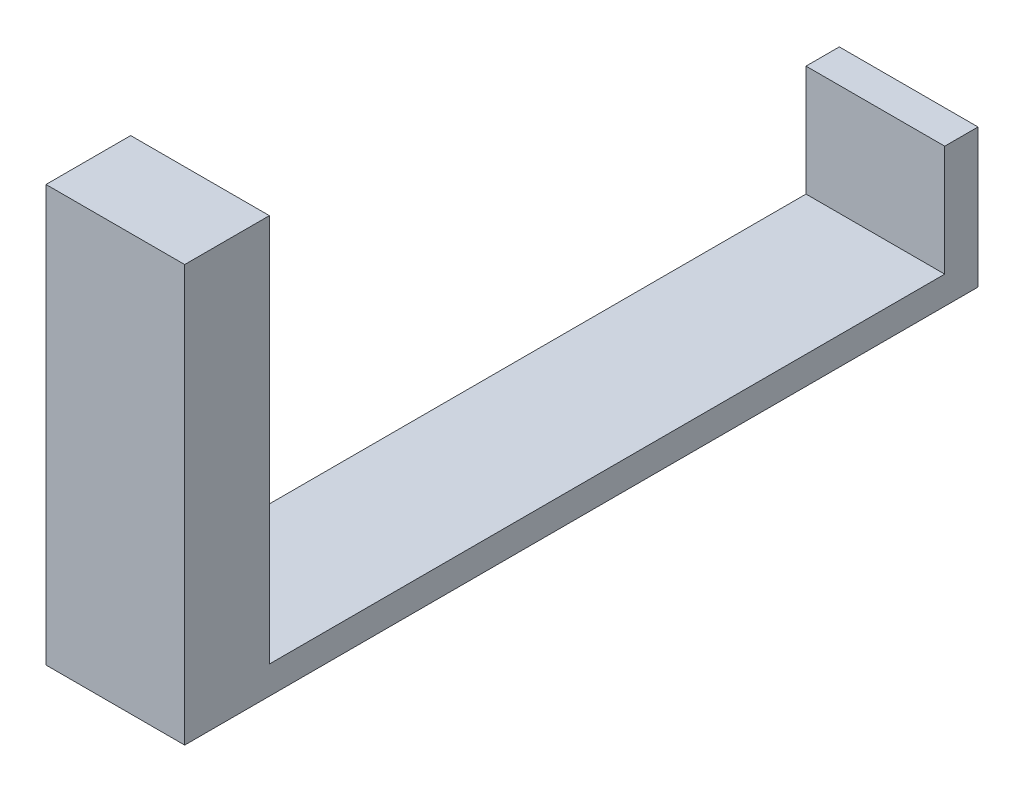
ISO-10303-21;
HEADER;
FILE_DESCRIPTION(('STEP AP214'),'2;1');
FILE_NAME('part.step','',(''),(''),'','','');
FILE_SCHEMA(('AUTOMOTIVE_DESIGN { 1 0 10303 214 1 1 1 1 }'));
ENDSEC;
DATA;
#1=APPLICATION_CONTEXT('core data for automotive mechanical design processes');
#2=APPLICATION_PROTOCOL_DEFINITION('international standard','automotive_design',2000,#1);
#3=PRODUCT_CONTEXT('',#1,'mechanical');
#4=PRODUCT('Part','Part','',(#3));
#5=PRODUCT_RELATED_PRODUCT_CATEGORY('part','',(#4));
#6=PRODUCT_DEFINITION_FORMATION('','',#4);
#7=PRODUCT_DEFINITION_CONTEXT('part definition',#1,'design');
#8=PRODUCT_DEFINITION('design','',#6,#7);
#9=PRODUCT_DEFINITION_SHAPE('','',#8);
#10=(LENGTH_UNIT() NAMED_UNIT(*) SI_UNIT(.MILLI.,.METRE.));
#11=(NAMED_UNIT(*) PLANE_ANGLE_UNIT() SI_UNIT($,.RADIAN.));
#12=(NAMED_UNIT(*) SI_UNIT($,.STERADIAN.) SOLID_ANGLE_UNIT());
#13=UNCERTAINTY_MEASURE_WITH_UNIT(LENGTH_MEASURE(1.E-05),#10,'distance_accuracy_value','');
#14=(GEOMETRIC_REPRESENTATION_CONTEXT(3) GLOBAL_UNCERTAINTY_ASSIGNED_CONTEXT((#13)) GLOBAL_UNIT_ASSIGNED_CONTEXT((#10,
#11,#12)) REPRESENTATION_CONTEXT('',''));
#15=CARTESIAN_POINT('',(0.,0.,0.));
#16=DIRECTION('',(0.,0.,1.));
#17=DIRECTION('',(1.,0.,0.));
#18=AXIS2_PLACEMENT_3D('',#15,#16,#17);
#19=CARTESIAN_POINT('',(0.,50.2336626959557,1430.));
#20=DIRECTION('',(0.,-1.,0.));
#21=DIRECTION('',(0.,0.,-1.));
#22=AXIS2_PLACEMENT_3D('',#19,#20,#21);
#23=PLANE('',#22);
#24=DIRECTION('',(-1.,0.,0.));
#25=VECTOR('',#24,1.);
#26=CARTESIAN_POINT('',(0.,50.2336626959557,1277.33604646102));
#27=LINE('',#26,#25);
#28=CARTESIAN_POINT('',(0.,50.2336626959557,1277.33604646102));
#29=VERTEX_POINT('',#28);
#30=CARTESIAN_POINT('',(-250.,50.2336626959557,1277.33604646102));
#31=VERTEX_POINT('',#30);
#32=EDGE_CURVE('E170',#29,#31,#27,.T.);
#33=ORIENTED_EDGE('',*,*,#32,.F.);
#34=DIRECTION('',(0.,0.,-1.));
#35=VECTOR('',#34,1.);
#36=CARTESIAN_POINT('',(0.,50.2336626959557,1430.));
#37=LINE('',#36,#35);
#38=CARTESIAN_POINT('',(0.,50.2336626959557,60.));
#39=VERTEX_POINT('',#38);
#40=EDGE_CURVE('E61',#29,#39,#37,.T.);
#41=ORIENTED_EDGE('',*,*,#40,.T.);
#42=DIRECTION('',(-1.,0.,0.));
#43=VECTOR('',#42,1.);
#44=CARTESIAN_POINT('',(0.,50.2336626959557,60.));
#45=LINE('',#44,#43);
#46=CARTESIAN_POINT('',(-250.,50.2336626959557,60.));
#47=VERTEX_POINT('',#46);
#48=EDGE_CURVE('E139',#39,#47,#45,.T.);
#49=ORIENTED_EDGE('',*,*,#48,.T.);
#50=DIRECTION('',(0.,0.,-1.));
#51=VECTOR('',#50,1.);
#52=CARTESIAN_POINT('',(-250.,50.2336626959557,1430.));
#53=LINE('',#52,#51);
#54=EDGE_CURVE('E156',#31,#47,#53,.T.);
#55=ORIENTED_EDGE('',*,*,#54,.F.);
#56=EDGE_LOOP('',(#33,#41,#49,#55));
#57=FACE_BOUND('',#56,.T.);
#58=ADVANCED_FACE('F43',(#57),#23,.F.);
#59=CARTESIAN_POINT('',(0.,0.,60.));
#60=DIRECTION('',(0.,0.,-1.));
#61=DIRECTION('',(-1.,0.,0.));
#62=AXIS2_PLACEMENT_3D('',#59,#60,#61);
#63=PLANE('',#62);
#64=ORIENTED_EDGE('',*,*,#48,.F.);
#65=DIRECTION('',(0.,-1.,0.));
#66=VECTOR('',#65,1.);
#67=CARTESIAN_POINT('',(0.,250.,60.));
#68=LINE('',#67,#66);
#69=CARTESIAN_POINT('',(0.,250.,60.));
#70=VERTEX_POINT('',#69);
#71=EDGE_CURVE('E127',#70,#39,#68,.T.);
#72=ORIENTED_EDGE('',*,*,#71,.F.);
#73=DIRECTION('',(1.,0.,0.));
#74=VECTOR('',#73,1.);
#75=CARTESIAN_POINT('',(-250.,250.,60.));
#76=LINE('',#75,#74);
#77=CARTESIAN_POINT('',(-250.,250.,60.));
#78=VERTEX_POINT('',#77);
#79=EDGE_CURVE('E117',#78,#70,#76,.T.);
#80=ORIENTED_EDGE('',*,*,#79,.F.);
#81=DIRECTION('',(0.,1.,0.));
#82=VECTOR('',#81,1.);
#83=CARTESIAN_POINT('',(-250.,0.,60.));
#84=LINE('',#83,#82);
#85=EDGE_CURVE('E113',#47,#78,#84,.T.);
#86=ORIENTED_EDGE('',*,*,#85,.F.);
#87=EDGE_LOOP('',(#64,#72,#80,#86));
#88=FACE_BOUND('',#87,.T.);
#89=ADVANCED_FACE('F137',(#88),#63,.F.);
#90=CARTESIAN_POINT('',(-250.,0.,60.));
#91=DIRECTION('',(-1.,0.,0.));
#92=DIRECTION('',(0.,0.,1.));
#93=AXIS2_PLACEMENT_3D('',#90,#91,#92);
#94=PLANE('',#93);
#95=DIRECTION('',(0.,1.,0.));
#96=VECTOR('',#95,1.);
#97=CARTESIAN_POINT('',(-250.,0.,0.));
#98=LINE('',#97,#96);
#99=CARTESIAN_POINT('',(-250.,0.,0.));
#100=VERTEX_POINT('',#99);
#101=CARTESIAN_POINT('',(-250.,250.,0.));
#102=VERTEX_POINT('',#101);
#103=EDGE_CURVE('E101',#100,#102,#98,.T.);
#104=ORIENTED_EDGE('',*,*,#103,.F.);
#105=DIRECTION('',(0.,0.,-1.));
#106=VECTOR('',#105,1.);
#107=CARTESIAN_POINT('',(-250.,0.,60.));
#108=LINE('',#107,#106);
#109=CARTESIAN_POINT('',(-250.,0.,1430.));
#110=VERTEX_POINT('',#109);
#111=EDGE_CURVE('E11',#110,#100,#108,.T.);
#112=ORIENTED_EDGE('',*,*,#111,.F.);
#113=DIRECTION('',(0.,-1.,0.));
#114=VECTOR('',#113,1.);
#115=CARTESIAN_POINT('',(-250.,50.2336626959557,1430.));
#116=LINE('',#115,#114);
#117=CARTESIAN_POINT('',(-250.,750.233662695956,1430.));
#118=VERTEX_POINT('',#117);
#119=EDGE_CURVE('E148',#118,#110,#116,.T.);
#120=ORIENTED_EDGE('',*,*,#119,.F.);
#121=DIRECTION('',(0.,0.,1.));
#122=VECTOR('',#121,1.);
#123=CARTESIAN_POINT('',(-250.,750.233662695956,1277.33604646102));
#124=LINE('',#123,#122);
#125=CARTESIAN_POINT('',(-250.,750.233662695956,1277.33604646102));
#126=VERTEX_POINT('',#125);
#127=EDGE_CURVE('E178',#126,#118,#124,.T.);
#128=ORIENTED_EDGE('',*,*,#127,.F.);
#129=DIRECTION('',(0.,-1.,0.));
#130=VECTOR('',#129,1.);
#131=CARTESIAN_POINT('',(-250.,750.233662695956,1277.33604646102));
#132=LINE('',#131,#130);
#133=EDGE_CURVE('E151',#126,#31,#132,.T.);
#134=ORIENTED_EDGE('',*,*,#133,.T.);
#135=ORIENTED_EDGE('',*,*,#54,.T.);
#136=ORIENTED_EDGE('',*,*,#85,.T.);
#137=DIRECTION('',(0.,0.,-1.));
#138=VECTOR('',#137,1.);
#139=CARTESIAN_POINT('',(-250.,250.,60.));
#140=LINE('',#139,#138);
#141=EDGE_CURVE('E47',#78,#102,#140,.T.);
#142=ORIENTED_EDGE('',*,*,#141,.T.);
#143=EDGE_LOOP('',(#104,#112,#120,#128,#134,#135,#136,#142));
#144=FACE_BOUND('',#143,.T.);
#145=ADVANCED_FACE('F45',(#144),#94,.T.);
#146=CARTESIAN_POINT('',(0.,0.,60.));
#147=DIRECTION('',(0.,-1.,0.));
#148=DIRECTION('',(1.,0.,0.));
#149=AXIS2_PLACEMENT_3D('',#146,#147,#148);
#150=PLANE('',#149);
#151=DIRECTION('',(-1.,0.,0.));
#152=VECTOR('',#151,1.);
#153=CARTESIAN_POINT('',(0.,0.,0.));
#154=LINE('',#153,#152);
#155=CARTESIAN_POINT('',(0.,0.,0.));
#156=VERTEX_POINT('',#155);
#157=EDGE_CURVE('E93',#156,#100,#154,.T.);
#158=ORIENTED_EDGE('',*,*,#157,.F.);
#159=DIRECTION('',(0.,0.,-1.));
#160=VECTOR('',#159,1.);
#161=CARTESIAN_POINT('',(0.,0.,60.));
#162=LINE('',#161,#160);
#163=CARTESIAN_POINT('',(0.,0.,1430.));
#164=VERTEX_POINT('',#163);
#165=EDGE_CURVE('E53',#164,#156,#162,.T.);
#166=ORIENTED_EDGE('',*,*,#165,.F.);
#167=DIRECTION('',(1.,0.,0.));
#168=VECTOR('',#167,1.);
#169=CARTESIAN_POINT('',(-250.,0.,1430.));
#170=LINE('',#169,#168);
#171=EDGE_CURVE('E96',#110,#164,#170,.T.);
#172=ORIENTED_EDGE('',*,*,#171,.F.);
#173=ORIENTED_EDGE('',*,*,#111,.T.);
#174=EDGE_LOOP('',(#158,#166,#172,#173));
#175=FACE_BOUND('',#174,.T.);
#176=ADVANCED_FACE('F90',(#175),#150,.T.);
#177=CARTESIAN_POINT('',(0.,250.,60.));
#178=DIRECTION('',(1.,0.,0.));
#179=DIRECTION('',(0.,1.,0.));
#180=AXIS2_PLACEMENT_3D('',#177,#178,#179);
#181=PLANE('',#180);
#182=DIRECTION('',(0.,-1.,0.));
#183=VECTOR('',#182,1.);
#184=CARTESIAN_POINT('',(0.,250.,0.));
#185=LINE('',#184,#183);
#186=CARTESIAN_POINT('',(0.,250.,0.));
#187=VERTEX_POINT('',#186);
#188=EDGE_CURVE('E111',#187,#156,#185,.T.);
#189=ORIENTED_EDGE('',*,*,#188,.F.);
#190=DIRECTION('',(0.,0.,-1.));
#191=VECTOR('',#190,1.);
#192=CARTESIAN_POINT('',(0.,250.,60.));
#193=LINE('',#192,#191);
#194=EDGE_CURVE('E70',#70,#187,#193,.T.);
#195=ORIENTED_EDGE('',*,*,#194,.F.);
#196=ORIENTED_EDGE('',*,*,#71,.T.);
#197=ORIENTED_EDGE('',*,*,#40,.F.);
#198=DIRECTION('',(0.,-1.,0.));
#199=VECTOR('',#198,1.);
#200=CARTESIAN_POINT('',(0.,750.233662695956,1277.33604646102));
#201=LINE('',#200,#199);
#202=CARTESIAN_POINT('',(0.,750.233662695956,1277.33604646102));
#203=VERTEX_POINT('',#202);
#204=EDGE_CURVE('E143',#203,#29,#201,.T.);
#205=ORIENTED_EDGE('',*,*,#204,.F.);
#206=DIRECTION('',(0.,0.,-1.));
#207=VECTOR('',#206,1.);
#208=CARTESIAN_POINT('',(0.,750.233662695956,1430.));
#209=LINE('',#208,#207);
#210=CARTESIAN_POINT('',(0.,750.233662695956,1430.));
#211=VERTEX_POINT('',#210);
#212=EDGE_CURVE('E174',#211,#203,#209,.T.);
#213=ORIENTED_EDGE('',*,*,#212,.F.);
#214=DIRECTION('',(0.,1.,0.));
#215=VECTOR('',#214,1.);
#216=CARTESIAN_POINT('',(0.,0.,1430.));
#217=LINE('',#216,#215);
#218=EDGE_CURVE('E142',#164,#211,#217,.T.);
#219=ORIENTED_EDGE('',*,*,#218,.F.);
#220=ORIENTED_EDGE('',*,*,#165,.T.);
#221=EDGE_LOOP('',(#189,#195,#196,#197,#205,#213,#219,#220));
#222=FACE_BOUND('',#221,.T.);
#223=ADVANCED_FACE('F200',(#222),#181,.T.);
#224=CARTESIAN_POINT('',(-250.,250.,60.));
#225=DIRECTION('',(0.,1.,0.));
#226=DIRECTION('',(-1.,0.,0.));
#227=AXIS2_PLACEMENT_3D('',#224,#225,#226);
#228=PLANE('',#227);
#229=DIRECTION('',(1.,0.,0.));
#230=VECTOR('',#229,1.);
#231=CARTESIAN_POINT('',(-250.,250.,0.));
#232=LINE('',#231,#230);
#233=EDGE_CURVE('E107',#102,#187,#232,.T.);
#234=ORIENTED_EDGE('',*,*,#233,.F.);
#235=ORIENTED_EDGE('',*,*,#141,.F.);
#236=ORIENTED_EDGE('',*,*,#79,.T.);
#237=ORIENTED_EDGE('',*,*,#194,.T.);
#238=EDGE_LOOP('',(#234,#235,#236,#237));
#239=FACE_BOUND('',#238,.T.);
#240=ADVANCED_FACE('F133',(#239),#228,.T.);
#241=CARTESIAN_POINT('',(0.,0.,0.));
#242=DIRECTION('',(0.,0.,-1.));
#243=DIRECTION('',(-1.,0.,0.));
#244=AXIS2_PLACEMENT_3D('',#241,#242,#243);
#245=PLANE('',#244);
#246=ORIENTED_EDGE('',*,*,#103,.T.);
#247=ORIENTED_EDGE('',*,*,#233,.T.);
#248=ORIENTED_EDGE('',*,*,#188,.T.);
#249=ORIENTED_EDGE('',*,*,#157,.T.);
#250=EDGE_LOOP('',(#246,#247,#248,#249));
#251=FACE_BOUND('',#250,.T.);
#252=ADVANCED_FACE('F110',(#251),#245,.T.);
#253=CARTESIAN_POINT('',(0.,0.,1430.));
#254=DIRECTION('',(0.,0.,1.));
#255=DIRECTION('',(1.,0.,0.));
#256=AXIS2_PLACEMENT_3D('',#253,#254,#255);
#257=PLANE('',#256);
#258=ORIENTED_EDGE('',*,*,#218,.T.);
#259=DIRECTION('',(1.,0.,0.));
#260=VECTOR('',#259,1.);
#261=CARTESIAN_POINT('',(-250.,750.233662695956,1430.));
#262=LINE('',#261,#260);
#263=EDGE_CURVE('E169',#118,#211,#262,.T.);
#264=ORIENTED_EDGE('',*,*,#263,.F.);
#265=ORIENTED_EDGE('',*,*,#119,.T.);
#266=ORIENTED_EDGE('',*,*,#171,.T.);
#267=EDGE_LOOP('',(#258,#264,#265,#266));
#268=FACE_BOUND('',#267,.T.);
#269=ADVANCED_FACE('F213',(#268),#257,.T.);
#270=CARTESIAN_POINT('',(0.,750.233662695956,1277.33604646102));
#271=DIRECTION('',(0.,0.,1.));
#272=DIRECTION('',(1.,0.,0.));
#273=AXIS2_PLACEMENT_3D('',#270,#271,#272);
#274=PLANE('',#273);
#275=ORIENTED_EDGE('',*,*,#32,.T.);
#276=ORIENTED_EDGE('',*,*,#133,.F.);
#277=DIRECTION('',(-1.,0.,0.));
#278=VECTOR('',#277,1.);
#279=CARTESIAN_POINT('',(0.,750.233662695956,1277.33604646102));
#280=LINE('',#279,#278);
#281=EDGE_CURVE('E182',#203,#126,#280,.T.);
#282=ORIENTED_EDGE('',*,*,#281,.F.);
#283=ORIENTED_EDGE('',*,*,#204,.T.);
#284=EDGE_LOOP('',(#275,#276,#282,#283));
#285=FACE_BOUND('',#284,.T.);
#286=ADVANCED_FACE('F203',(#285),#274,.F.);
#287=CARTESIAN_POINT('',(0.,750.233662695956,0.));
#288=DIRECTION('',(0.,1.,0.));
#289=DIRECTION('',(0.,0.,1.));
#290=AXIS2_PLACEMENT_3D('',#287,#288,#289);
#291=PLANE('',#290);
#292=ORIENTED_EDGE('',*,*,#212,.T.);
#293=ORIENTED_EDGE('',*,*,#281,.T.);
#294=ORIENTED_EDGE('',*,*,#127,.T.);
#295=ORIENTED_EDGE('',*,*,#263,.T.);
#296=EDGE_LOOP('',(#292,#293,#294,#295));
#297=FACE_BOUND('',#296,.T.);
#298=ADVANCED_FACE('F192',(#297),#291,.T.);
#299=CLOSED_SHELL('',(#58,#89,#145,#176,#223,#240,#252,#269,#286,#298));
#300=MANIFOLD_SOLID_BREP('B2',#299);
#301=ADVANCED_BREP_SHAPE_REPRESENTATION('',(#18,#300),#14);
#302=SHAPE_DEFINITION_REPRESENTATION(#9,#301);
ENDSEC;
END-ISO-10303-21;
